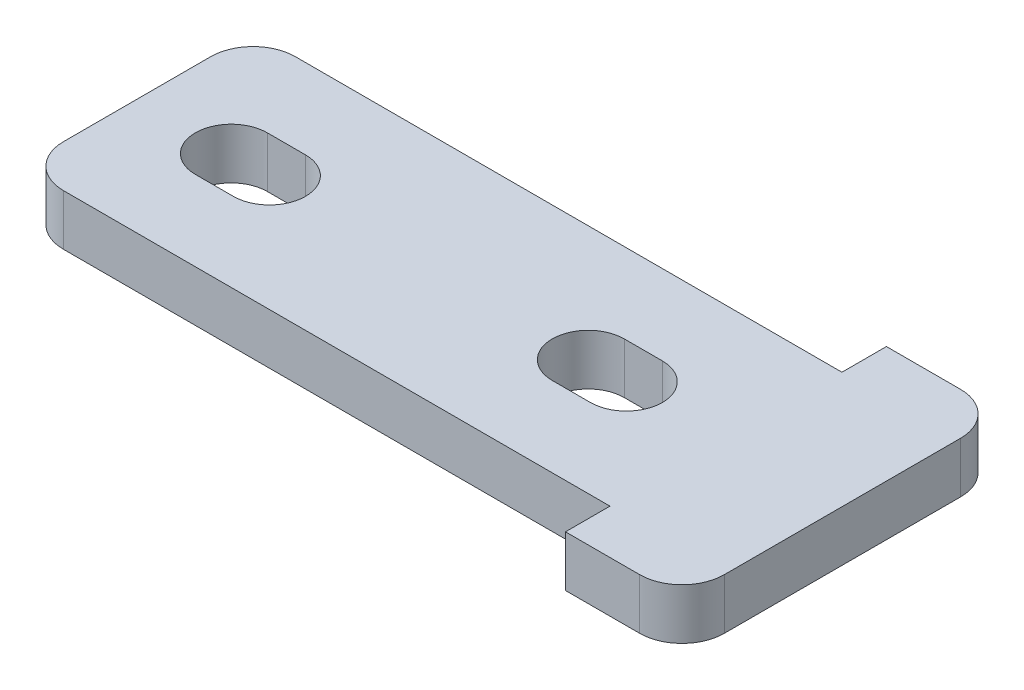
ISO-10303-21;
HEADER;
FILE_DESCRIPTION(('STEP AP214'),'2;1');
FILE_NAME('part.step','',(''),(''),'','','');
FILE_SCHEMA(('AUTOMOTIVE_DESIGN { 1 0 10303 214 1 1 1 1 }'));
ENDSEC;
DATA;
#1=APPLICATION_CONTEXT('core data for automotive mechanical design processes');
#2=APPLICATION_PROTOCOL_DEFINITION('international standard','automotive_design',2000,#1);
#3=PRODUCT_CONTEXT('',#1,'mechanical');
#4=PRODUCT('Part','Part','',(#3));
#5=PRODUCT_RELATED_PRODUCT_CATEGORY('part','',(#4));
#6=PRODUCT_DEFINITION_FORMATION('','',#4);
#7=PRODUCT_DEFINITION_CONTEXT('part definition',#1,'design');
#8=PRODUCT_DEFINITION('design','',#6,#7);
#9=PRODUCT_DEFINITION_SHAPE('','',#8);
#10=(LENGTH_UNIT() NAMED_UNIT(*) SI_UNIT(.MILLI.,.METRE.));
#11=(NAMED_UNIT(*) PLANE_ANGLE_UNIT() SI_UNIT($,.RADIAN.));
#12=(NAMED_UNIT(*) SI_UNIT($,.STERADIAN.) SOLID_ANGLE_UNIT());
#13=UNCERTAINTY_MEASURE_WITH_UNIT(LENGTH_MEASURE(1.E-05),#10,'distance_accuracy_value','');
#14=(GEOMETRIC_REPRESENTATION_CONTEXT(3) GLOBAL_UNCERTAINTY_ASSIGNED_CONTEXT((#13)) GLOBAL_UNIT_ASSIGNED_CONTEXT((#10,
#11,#12)) REPRESENTATION_CONTEXT('',''));
#15=CARTESIAN_POINT('',(0.,0.,0.));
#16=DIRECTION('',(0.,0.,1.));
#17=DIRECTION('',(1.,0.,0.));
#18=AXIS2_PLACEMENT_3D('',#15,#16,#17);
#19=CARTESIAN_POINT('',(0.,-2.4,-15.15));
#20=DIRECTION('',(0.,0.,1.));
#21=DIRECTION('',(1.,0.,0.));
#22=AXIS2_PLACEMENT_3D('',#19,#20,#21);
#23=PLANE('',#22);
#24=DIRECTION('',(1.,0.,0.));
#25=VECTOR('',#24,1.);
#26=CARTESIAN_POINT('',(0.,0.,-15.15));
#27=LINE('',#26,#25);
#28=CARTESIAN_POINT('',(27.8,0.,-15.15));
#29=VERTEX_POINT('',#28);
#30=CARTESIAN_POINT('',(31.3,0.,-15.15));
#31=VERTEX_POINT('',#30);
#32=EDGE_CURVE('E262',#29,#31,#27,.T.);
#33=ORIENTED_EDGE('',*,*,#32,.T.);
#34=DIRECTION('',(0.,1.,0.));
#35=VECTOR('',#34,1.);
#36=CARTESIAN_POINT('',(31.3,-2.4,-15.15));
#37=LINE('',#36,#35);
#38=CARTESIAN_POINT('',(31.3,-2.4,-15.15));
#39=VERTEX_POINT('',#38);
#40=EDGE_CURVE('E11',#31,#39,#37,.F.);
#41=ORIENTED_EDGE('',*,*,#40,.T.);
#42=DIRECTION('',(1.,0.,0.));
#43=VECTOR('',#42,1.);
#44=CARTESIAN_POINT('',(0.,-2.4,-15.15));
#45=LINE('',#44,#43);
#46=CARTESIAN_POINT('',(27.8,-2.4,-15.15));
#47=VERTEX_POINT('',#46);
#48=EDGE_CURVE('E225',#47,#39,#45,.T.);
#49=ORIENTED_EDGE('',*,*,#48,.F.);
#50=DIRECTION('',(0.,1.,0.));
#51=VECTOR('',#50,1.);
#52=CARTESIAN_POINT('',(27.8,-2.4,-15.15));
#53=LINE('',#52,#51);
#54=EDGE_CURVE('E289',#47,#29,#53,.T.);
#55=ORIENTED_EDGE('',*,*,#54,.T.);
#56=EDGE_LOOP('',(#33,#41,#49,#55));
#57=FACE_BOUND('',#56,.T.);
#58=ADVANCED_FACE('F42',(#57),#23,.F.);
#59=CARTESIAN_POINT('',(33.3,-2.4,0.));
#60=DIRECTION('',(1.,0.,0.));
#61=DIRECTION('',(0.,0.,-1.));
#62=AXIS2_PLACEMENT_3D('',#59,#60,#61);
#63=PLANE('',#62);
#64=DIRECTION('',(0.,0.,-1.));
#65=VECTOR('',#64,1.);
#66=CARTESIAN_POINT('',(33.3,0.,0.));
#67=LINE('',#66,#65);
#68=CARTESIAN_POINT('',(33.3,0.,-2.));
#69=VERTEX_POINT('',#68);
#70=CARTESIAN_POINT('',(33.3,0.,-13.15));
#71=VERTEX_POINT('',#70);
#72=EDGE_CURVE('E207',#69,#71,#67,.T.);
#73=ORIENTED_EDGE('',*,*,#72,.F.);
#74=DIRECTION('',(0.,1.,0.));
#75=VECTOR('',#74,1.);
#76=CARTESIAN_POINT('',(33.3,-2.4,-2.));
#77=LINE('',#76,#75);
#78=CARTESIAN_POINT('',(33.3,-2.4,-2.));
#79=VERTEX_POINT('',#78);
#80=EDGE_CURVE('E50',#69,#79,#77,.F.);
#81=ORIENTED_EDGE('',*,*,#80,.T.);
#82=DIRECTION('',(0.,0.,-1.));
#83=VECTOR('',#82,1.);
#84=CARTESIAN_POINT('',(33.3,-2.4,0.));
#85=LINE('',#84,#83);
#86=CARTESIAN_POINT('',(33.3,-2.4,-13.15));
#87=VERTEX_POINT('',#86);
#88=EDGE_CURVE('E202',#79,#87,#85,.T.);
#89=ORIENTED_EDGE('',*,*,#88,.T.);
#90=DIRECTION('',(0.,1.,0.));
#91=VECTOR('',#90,1.);
#92=CARTESIAN_POINT('',(33.3,0.,-13.15));
#93=LINE('',#92,#91);
#94=EDGE_CURVE('E331',#87,#71,#93,.T.);
#95=ORIENTED_EDGE('',*,*,#94,.T.);
#96=EDGE_LOOP('',(#73,#81,#89,#95));
#97=FACE_BOUND('',#96,.T.);
#98=ADVANCED_FACE('F336',(#97),#63,.T.);
#99=CARTESIAN_POINT('',(0.,-2.4,0.));
#100=DIRECTION('',(0.,0.,1.));
#101=DIRECTION('',(1.,0.,0.));
#102=AXIS2_PLACEMENT_3D('',#99,#100,#101);
#103=PLANE('',#102);
#104=DIRECTION('',(1.,0.,0.));
#105=VECTOR('',#104,1.);
#106=CARTESIAN_POINT('',(0.,-2.4,0.));
#107=LINE('',#106,#105);
#108=CARTESIAN_POINT('',(27.8,-2.4,0.));
#109=VERTEX_POINT('',#108);
#110=CARTESIAN_POINT('',(31.3,-2.4,0.));
#111=VERTEX_POINT('',#110);
#112=EDGE_CURVE('E240',#109,#111,#107,.T.);
#113=ORIENTED_EDGE('',*,*,#112,.T.);
#114=DIRECTION('',(0.,1.,0.));
#115=VECTOR('',#114,1.);
#116=CARTESIAN_POINT('',(31.3,-2.4,0.));
#117=LINE('',#116,#115);
#118=CARTESIAN_POINT('',(31.3,0.,0.));
#119=VERTEX_POINT('',#118);
#120=EDGE_CURVE('E328',#111,#119,#117,.T.);
#121=ORIENTED_EDGE('',*,*,#120,.T.);
#122=DIRECTION('',(1.,0.,0.));
#123=VECTOR('',#122,1.);
#124=CARTESIAN_POINT('',(0.,0.,0.));
#125=LINE('',#124,#123);
#126=CARTESIAN_POINT('',(27.8,0.,0.));
#127=VERTEX_POINT('',#126);
#128=EDGE_CURVE('E210',#127,#119,#125,.T.);
#129=ORIENTED_EDGE('',*,*,#128,.F.);
#130=DIRECTION('',(0.,1.,0.));
#131=VECTOR('',#130,1.);
#132=CARTESIAN_POINT('',(27.8,-2.4,0.));
#133=LINE('',#132,#131);
#134=EDGE_CURVE('E280',#109,#127,#133,.T.);
#135=ORIENTED_EDGE('',*,*,#134,.F.);
#136=EDGE_LOOP('',(#113,#121,#129,#135));
#137=FACE_BOUND('',#136,.T.);
#138=ADVANCED_FACE('F345',(#137),#103,.T.);
#139=CARTESIAN_POINT('',(27.8,-2.4,0.));
#140=DIRECTION('',(1.,0.,0.));
#141=DIRECTION('',(0.,0.,-1.));
#142=AXIS2_PLACEMENT_3D('',#139,#140,#141);
#143=PLANE('',#142);
#144=DIRECTION('',(0.,0.,-1.));
#145=VECTOR('',#144,1.);
#146=CARTESIAN_POINT('',(27.8,0.,0.));
#147=LINE('',#146,#145);
#148=CARTESIAN_POINT('',(27.8,0.,-2.1));
#149=VERTEX_POINT('',#148);
#150=EDGE_CURVE('E275',#127,#149,#147,.T.);
#151=ORIENTED_EDGE('',*,*,#150,.T.);
#152=DIRECTION('',(0.,1.,0.));
#153=VECTOR('',#152,1.);
#154=CARTESIAN_POINT('',(27.8,-2.4,-2.1));
#155=LINE('',#154,#153);
#156=CARTESIAN_POINT('',(27.8,-2.4,-2.1));
#157=VERTEX_POINT('',#156);
#158=EDGE_CURVE('E283',#157,#149,#155,.T.);
#159=ORIENTED_EDGE('',*,*,#158,.F.);
#160=DIRECTION('',(0.,0.,-1.));
#161=VECTOR('',#160,1.);
#162=CARTESIAN_POINT('',(27.8,-2.4,0.));
#163=LINE('',#162,#161);
#164=EDGE_CURVE('E237',#109,#157,#163,.T.);
#165=ORIENTED_EDGE('',*,*,#164,.F.);
#166=ORIENTED_EDGE('',*,*,#134,.T.);
#167=EDGE_LOOP('',(#151,#159,#165,#166));
#168=FACE_BOUND('',#167,.T.);
#169=ADVANCED_FACE('F353',(#168),#143,.F.);
#170=CARTESIAN_POINT('',(0.,-2.4,-2.1));
#171=DIRECTION('',(0.,0.,1.));
#172=DIRECTION('',(1.,0.,0.));
#173=AXIS2_PLACEMENT_3D('',#170,#171,#172);
#174=PLANE('',#173);
#175=DIRECTION('',(1.,0.,0.));
#176=VECTOR('',#175,1.);
#177=CARTESIAN_POINT('',(0.,0.,-2.1));
#178=LINE('',#177,#176);
#179=CARTESIAN_POINT('',(2.,0.,-2.1));
#180=VERTEX_POINT('',#179);
#181=EDGE_CURVE('E273',#180,#149,#178,.T.);
#182=ORIENTED_EDGE('',*,*,#181,.F.);
#183=DIRECTION('',(0.,1.,0.));
#184=VECTOR('',#183,1.);
#185=CARTESIAN_POINT('',(2.,-2.4,-2.1));
#186=LINE('',#185,#184);
#187=CARTESIAN_POINT('',(2.,-2.4,-2.1));
#188=VERTEX_POINT('',#187);
#189=EDGE_CURVE('E317',#180,#188,#186,.F.);
#190=ORIENTED_EDGE('',*,*,#189,.T.);
#191=DIRECTION('',(1.,0.,0.));
#192=VECTOR('',#191,1.);
#193=CARTESIAN_POINT('',(0.,-2.4,-2.1));
#194=LINE('',#193,#192);
#195=EDGE_CURVE('E235',#188,#157,#194,.T.);
#196=ORIENTED_EDGE('',*,*,#195,.T.);
#197=ORIENTED_EDGE('',*,*,#158,.T.);
#198=EDGE_LOOP('',(#182,#190,#196,#197));
#199=FACE_BOUND('',#198,.T.);
#200=ADVANCED_FACE('F535',(#199),#174,.T.);
#201=CARTESIAN_POINT('',(0.,-2.4,0.));
#202=DIRECTION('',(1.,0.,0.));
#203=DIRECTION('',(0.,0.,-1.));
#204=AXIS2_PLACEMENT_3D('',#201,#202,#203);
#205=PLANE('',#204);
#206=DIRECTION('',(0.,0.,-1.));
#207=VECTOR('',#206,1.);
#208=CARTESIAN_POINT('',(0.,-2.4,0.));
#209=LINE('',#208,#207);
#210=CARTESIAN_POINT('',(0.,-2.4,-4.1));
#211=VERTEX_POINT('',#210);
#212=CARTESIAN_POINT('',(0.,-2.4,-11.05));
#213=VERTEX_POINT('',#212);
#214=EDGE_CURVE('E233',#211,#213,#209,.T.);
#215=ORIENTED_EDGE('',*,*,#214,.F.);
#216=DIRECTION('',(0.,1.,0.));
#217=VECTOR('',#216,1.);
#218=CARTESIAN_POINT('',(0.,0.,-4.1));
#219=LINE('',#218,#217);
#220=CARTESIAN_POINT('',(0.,0.,-4.1));
#221=VERTEX_POINT('',#220);
#222=EDGE_CURVE('E306',#211,#221,#219,.T.);
#223=ORIENTED_EDGE('',*,*,#222,.T.);
#224=DIRECTION('',(0.,0.,-1.));
#225=VECTOR('',#224,1.);
#226=CARTESIAN_POINT('',(0.,0.,0.));
#227=LINE('',#226,#225);
#228=CARTESIAN_POINT('',(0.,0.,-11.05));
#229=VERTEX_POINT('',#228);
#230=EDGE_CURVE('E270',#221,#229,#227,.T.);
#231=ORIENTED_EDGE('',*,*,#230,.T.);
#232=DIRECTION('',(0.,1.,0.));
#233=VECTOR('',#232,1.);
#234=CARTESIAN_POINT('',(0.,-2.4,-11.05));
#235=LINE('',#234,#233);
#236=EDGE_CURVE('E282',#229,#213,#235,.F.);
#237=ORIENTED_EDGE('',*,*,#236,.T.);
#238=EDGE_LOOP('',(#215,#223,#231,#237));
#239=FACE_BOUND('',#238,.T.);
#240=ADVANCED_FACE('F363',(#239),#205,.F.);
#241=CARTESIAN_POINT('',(0.,-2.4,-13.05));
#242=DIRECTION('',(0.,0.,1.));
#243=DIRECTION('',(1.,0.,0.));
#244=AXIS2_PLACEMENT_3D('',#241,#242,#243);
#245=PLANE('',#244);
#246=DIRECTION('',(1.,0.,0.));
#247=VECTOR('',#246,1.);
#248=CARTESIAN_POINT('',(0.,-2.4,-13.05));
#249=LINE('',#248,#247);
#250=CARTESIAN_POINT('',(2.,-2.4,-13.05));
#251=VERTEX_POINT('',#250);
#252=CARTESIAN_POINT('',(27.8,-2.4,-13.05));
#253=VERTEX_POINT('',#252);
#254=EDGE_CURVE('E231',#251,#253,#249,.T.);
#255=ORIENTED_EDGE('',*,*,#254,.F.);
#256=DIRECTION('',(0.,1.,0.));
#257=VECTOR('',#256,1.);
#258=CARTESIAN_POINT('',(2.,-2.4,-13.05));
#259=LINE('',#258,#257);
#260=CARTESIAN_POINT('',(2.,0.,-13.05));
#261=VERTEX_POINT('',#260);
#262=EDGE_CURVE('E325',#251,#261,#259,.T.);
#263=ORIENTED_EDGE('',*,*,#262,.T.);
#264=DIRECTION('',(1.,0.,0.));
#265=VECTOR('',#264,1.);
#266=CARTESIAN_POINT('',(0.,0.,-13.05));
#267=LINE('',#266,#265);
#268=CARTESIAN_POINT('',(27.8,0.,-13.05));
#269=VERTEX_POINT('',#268);
#270=EDGE_CURVE('E268',#261,#269,#267,.T.);
#271=ORIENTED_EDGE('',*,*,#270,.T.);
#272=DIRECTION('',(0.,1.,0.));
#273=VECTOR('',#272,1.);
#274=CARTESIAN_POINT('',(27.8,-2.4,-13.05));
#275=LINE('',#274,#273);
#276=EDGE_CURVE('E286',#253,#269,#275,.T.);
#277=ORIENTED_EDGE('',*,*,#276,.F.);
#278=EDGE_LOOP('',(#255,#263,#271,#277));
#279=FACE_BOUND('',#278,.T.);
#280=ADVANCED_FACE('F370',(#279),#245,.F.);
#281=CARTESIAN_POINT('',(21.3,-2.4,-7.575));
#282=DIRECTION('',(0.,1.,0.));
#283=DIRECTION('',(0.,0.,1.));
#284=AXIS2_PLACEMENT_3D('',#281,#282,#283);
#285=CYLINDRICAL_SURFACE('',#284,1.7);
#286=CARTESIAN_POINT('',(21.3,0.,-7.575));
#287=DIRECTION('',(0.,1.,0.));
#288=DIRECTION('',(0.,0.,1.));
#289=AXIS2_PLACEMENT_3D('',#286,#287,#288);
#290=CIRCLE('',#289,1.7);
#291=CARTESIAN_POINT('',(21.3,0.,-9.275));
#292=VERTEX_POINT('',#291);
#293=CARTESIAN_POINT('',(21.3,0.,-5.875));
#294=VERTEX_POINT('',#293);
#295=EDGE_CURVE('E252',#292,#294,#290,.T.);
#296=ORIENTED_EDGE('',*,*,#295,.T.);
#297=DIRECTION('',(0.,1.,0.));
#298=VECTOR('',#297,1.);
#299=CARTESIAN_POINT('',(21.3,-2.4,-5.875));
#300=LINE('',#299,#298);
#301=CARTESIAN_POINT('',(21.3,-2.4,-5.875));
#302=VERTEX_POINT('',#301);
#303=EDGE_CURVE('E291',#302,#294,#300,.T.);
#304=ORIENTED_EDGE('',*,*,#303,.F.);
#305=CARTESIAN_POINT('',(21.3,-2.4,-7.575));
#306=DIRECTION('',(0.,1.,0.));
#307=DIRECTION('',(0.,0.,1.));
#308=AXIS2_PLACEMENT_3D('',#305,#306,#307);
#309=CIRCLE('',#308,1.7);
#310=CARTESIAN_POINT('',(21.3,-2.4,-9.275));
#311=VERTEX_POINT('',#310);
#312=EDGE_CURVE('E216',#311,#302,#309,.T.);
#313=ORIENTED_EDGE('',*,*,#312,.F.);
#314=DIRECTION('',(0.,1.,0.));
#315=VECTOR('',#314,1.);
#316=CARTESIAN_POINT('',(21.3,-2.4,-9.275));
#317=LINE('',#316,#315);
#318=EDGE_CURVE('E298',#311,#292,#317,.T.);
#319=ORIENTED_EDGE('',*,*,#318,.T.);
#320=EDGE_LOOP('',(#296,#304,#313,#319));
#321=FACE_BOUND('',#320,.T.);
#322=ADVANCED_FACE('F398',(#321),#285,.F.);
#323=CARTESIAN_POINT('',(0.,-2.4,-5.875));
#324=DIRECTION('',(0.,0.,-1.));
#325=DIRECTION('',(-1.,0.,0.));
#326=AXIS2_PLACEMENT_3D('',#323,#324,#325);
#327=PLANE('',#326);
#328=DIRECTION('',(-1.,0.,0.));
#329=VECTOR('',#328,1.);
#330=CARTESIAN_POINT('',(0.,0.,-5.875));
#331=LINE('',#330,#329);
#332=CARTESIAN_POINT('',(23.1,0.,-5.875));
#333=VERTEX_POINT('',#332);
#334=EDGE_CURVE('E259',#333,#294,#331,.T.);
#335=ORIENTED_EDGE('',*,*,#334,.F.);
#336=DIRECTION('',(0.,1.,0.));
#337=VECTOR('',#336,1.);
#338=CARTESIAN_POINT('',(23.1,-2.4,-5.875));
#339=LINE('',#338,#337);
#340=CARTESIAN_POINT('',(23.1,-2.4,-5.875));
#341=VERTEX_POINT('',#340);
#342=EDGE_CURVE('E293',#341,#333,#339,.T.);
#343=ORIENTED_EDGE('',*,*,#342,.F.);
#344=DIRECTION('',(-1.,0.,0.));
#345=VECTOR('',#344,1.);
#346=CARTESIAN_POINT('',(0.,-2.4,-5.875));
#347=LINE('',#346,#345);
#348=EDGE_CURVE('E222',#341,#302,#347,.T.);
#349=ORIENTED_EDGE('',*,*,#348,.T.);
#350=ORIENTED_EDGE('',*,*,#303,.T.);
#351=EDGE_LOOP('',(#335,#343,#349,#350));
#352=FACE_BOUND('',#351,.T.);
#353=ADVANCED_FACE('F394',(#352),#327,.T.);
#354=CARTESIAN_POINT('',(23.1,-2.4,-7.575));
#355=DIRECTION('',(0.,1.,0.));
#356=DIRECTION('',(0.,0.,1.));
#357=AXIS2_PLACEMENT_3D('',#354,#355,#356);
#358=CYLINDRICAL_SURFACE('',#357,1.7);
#359=CARTESIAN_POINT('',(23.1,0.,-7.575));
#360=DIRECTION('',(0.,1.,0.));
#361=DIRECTION('',(0.,0.,1.));
#362=AXIS2_PLACEMENT_3D('',#359,#360,#361);
#363=CIRCLE('',#362,1.7);
#364=CARTESIAN_POINT('',(23.1,0.,-9.275));
#365=VERTEX_POINT('',#364);
#366=EDGE_CURVE('E257',#333,#365,#363,.T.);
#367=ORIENTED_EDGE('',*,*,#366,.T.);
#368=DIRECTION('',(0.,1.,0.));
#369=VECTOR('',#368,1.);
#370=CARTESIAN_POINT('',(23.1,-2.4,-9.275));
#371=LINE('',#370,#369);
#372=CARTESIAN_POINT('',(23.1,-2.4,-9.275));
#373=VERTEX_POINT('',#372);
#374=EDGE_CURVE('E295',#373,#365,#371,.T.);
#375=ORIENTED_EDGE('',*,*,#374,.F.);
#376=CARTESIAN_POINT('',(23.1,-2.4,-7.575));
#377=DIRECTION('',(0.,1.,0.));
#378=DIRECTION('',(0.,0.,1.));
#379=AXIS2_PLACEMENT_3D('',#376,#377,#378);
#380=CIRCLE('',#379,1.7);
#381=EDGE_CURVE('E220',#341,#373,#380,.T.);
#382=ORIENTED_EDGE('',*,*,#381,.F.);
#383=ORIENTED_EDGE('',*,*,#342,.T.);
#384=EDGE_LOOP('',(#367,#375,#382,#383));
#385=FACE_BOUND('',#384,.T.);
#386=ADVANCED_FACE('F397',(#385),#358,.F.);
#387=CARTESIAN_POINT('',(6.25,-2.4,-7.575));
#388=DIRECTION('',(0.,1.,0.));
#389=DIRECTION('',(0.,0.,1.));
#390=AXIS2_PLACEMENT_3D('',#387,#388,#389);
#391=CYLINDRICAL_SURFACE('',#390,1.7);
#392=CARTESIAN_POINT('',(6.25,0.,-7.575));
#393=DIRECTION('',(0.,1.,0.));
#394=DIRECTION('',(0.,0.,1.));
#395=AXIS2_PLACEMENT_3D('',#392,#393,#394);
#396=CIRCLE('',#395,1.7);
#397=CARTESIAN_POINT('',(6.25,0.,-5.875));
#398=VERTEX_POINT('',#397);
#399=CARTESIAN_POINT('',(6.25,0.,-9.275));
#400=VERTEX_POINT('',#399);
#401=EDGE_CURVE('E244',#398,#400,#396,.T.);
#402=ORIENTED_EDGE('',*,*,#401,.T.);
#403=DIRECTION('',(0.,1.,0.));
#404=VECTOR('',#403,1.);
#405=CARTESIAN_POINT('',(6.25,-2.4,-9.275));
#406=LINE('',#405,#404);
#407=CARTESIAN_POINT('',(6.25,-2.4,-9.275));
#408=VERTEX_POINT('',#407);
#409=EDGE_CURVE('E205',#408,#400,#406,.T.);
#410=ORIENTED_EDGE('',*,*,#409,.F.);
#411=CARTESIAN_POINT('',(6.25,-2.4,-7.575));
#412=DIRECTION('',(0.,1.,0.));
#413=DIRECTION('',(0.,0.,1.));
#414=AXIS2_PLACEMENT_3D('',#411,#412,#413);
#415=CIRCLE('',#414,1.7);
#416=CARTESIAN_POINT('',(6.25,-2.4,-5.875));
#417=VERTEX_POINT('',#416);
#418=EDGE_CURVE('E185',#417,#408,#415,.T.);
#419=ORIENTED_EDGE('',*,*,#418,.F.);
#420=DIRECTION('',(0.,1.,0.));
#421=VECTOR('',#420,1.);
#422=CARTESIAN_POINT('',(6.25,-2.4,-5.875));
#423=LINE('',#422,#421);
#424=EDGE_CURVE('E194',#417,#398,#423,.T.);
#425=ORIENTED_EDGE('',*,*,#424,.T.);
#426=EDGE_LOOP('',(#402,#410,#419,#425));
#427=FACE_BOUND('',#426,.T.);
#428=ADVANCED_FACE('F204',(#427),#391,.F.);
#429=CARTESIAN_POINT('',(0.,-2.4,-9.275));
#430=DIRECTION('',(0.,0.,1.));
#431=DIRECTION('',(1.,0.,0.));
#432=AXIS2_PLACEMENT_3D('',#429,#430,#431);
#433=PLANE('',#432);
#434=DIRECTION('',(1.,0.,0.));
#435=VECTOR('',#434,1.);
#436=CARTESIAN_POINT('',(0.,0.,-9.275));
#437=LINE('',#436,#435);
#438=CARTESIAN_POINT('',(4.45,0.,-9.275));
#439=VERTEX_POINT('',#438);
#440=EDGE_CURVE('E249',#439,#400,#437,.T.);
#441=ORIENTED_EDGE('',*,*,#440,.F.);
#442=DIRECTION('',(0.,1.,0.));
#443=VECTOR('',#442,1.);
#444=CARTESIAN_POINT('',(4.45,-2.4,-9.275));
#445=LINE('',#444,#443);
#446=CARTESIAN_POINT('',(4.45,-2.4,-9.275));
#447=VERTEX_POINT('',#446);
#448=EDGE_CURVE('E302',#447,#439,#445,.T.);
#449=ORIENTED_EDGE('',*,*,#448,.F.);
#450=DIRECTION('',(1.,0.,0.));
#451=VECTOR('',#450,1.);
#452=CARTESIAN_POINT('',(0.,-2.4,-9.275));
#453=LINE('',#452,#451);
#454=EDGE_CURVE('E214',#447,#408,#453,.T.);
#455=ORIENTED_EDGE('',*,*,#454,.T.);
#456=ORIENTED_EDGE('',*,*,#409,.T.);
#457=EDGE_LOOP('',(#441,#449,#455,#456));
#458=FACE_BOUND('',#457,.T.);
#459=ADVANCED_FACE('F411',(#458),#433,.T.);
#460=CARTESIAN_POINT('',(4.45,-2.4,-7.575));
#461=DIRECTION('',(0.,1.,0.));
#462=DIRECTION('',(0.,0.,1.));
#463=AXIS2_PLACEMENT_3D('',#460,#461,#462);
#464=CYLINDRICAL_SURFACE('',#463,1.7);
#465=CARTESIAN_POINT('',(4.45,0.,-7.575));
#466=DIRECTION('',(0.,1.,0.));
#467=DIRECTION('',(0.,0.,1.));
#468=AXIS2_PLACEMENT_3D('',#465,#466,#467);
#469=CIRCLE('',#468,1.7);
#470=CARTESIAN_POINT('',(4.45,0.,-5.875));
#471=VERTEX_POINT('',#470);
#472=EDGE_CURVE('E247',#439,#471,#469,.T.);
#473=ORIENTED_EDGE('',*,*,#472,.T.);
#474=DIRECTION('',(0.,1.,0.));
#475=VECTOR('',#474,1.);
#476=CARTESIAN_POINT('',(4.45,-2.4,-5.875));
#477=LINE('',#476,#475);
#478=CARTESIAN_POINT('',(4.45,-2.4,-5.875));
#479=VERTEX_POINT('',#478);
#480=EDGE_CURVE('E201',#479,#471,#477,.T.);
#481=ORIENTED_EDGE('',*,*,#480,.F.);
#482=CARTESIAN_POINT('',(4.45,-2.4,-7.575));
#483=DIRECTION('',(0.,1.,0.));
#484=DIRECTION('',(0.,0.,1.));
#485=AXIS2_PLACEMENT_3D('',#482,#483,#484);
#486=CIRCLE('',#485,1.7);
#487=EDGE_CURVE('E188',#447,#479,#486,.T.);
#488=ORIENTED_EDGE('',*,*,#487,.F.);
#489=ORIENTED_EDGE('',*,*,#448,.T.);
#490=EDGE_LOOP('',(#473,#481,#488,#489));
#491=FACE_BOUND('',#490,.T.);
#492=ADVANCED_FACE('F406',(#491),#464,.F.);
#493=CARTESIAN_POINT('',(0.,-2.4,-9.275));
#494=DIRECTION('',(0.,0.,-1.));
#495=DIRECTION('',(-1.,0.,0.));
#496=AXIS2_PLACEMENT_3D('',#493,#494,#495);
#497=PLANE('',#496);
#498=DIRECTION('',(-1.,0.,0.));
#499=VECTOR('',#498,1.);
#500=CARTESIAN_POINT('',(0.,0.,-9.275));
#501=LINE('',#500,#499);
#502=EDGE_CURVE('E255',#365,#292,#501,.T.);
#503=ORIENTED_EDGE('',*,*,#502,.T.);
#504=ORIENTED_EDGE('',*,*,#318,.F.);
#505=DIRECTION('',(-1.,0.,0.));
#506=VECTOR('',#505,1.);
#507=CARTESIAN_POINT('',(0.,-2.4,-9.275));
#508=LINE('',#507,#506);
#509=EDGE_CURVE('E218',#373,#311,#508,.T.);
#510=ORIENTED_EDGE('',*,*,#509,.F.);
#511=ORIENTED_EDGE('',*,*,#374,.T.);
#512=EDGE_LOOP('',(#503,#504,#510,#511));
#513=FACE_BOUND('',#512,.T.);
#514=ADVANCED_FACE('F403',(#513),#497,.F.);
#515=CARTESIAN_POINT('',(0.,-2.4,-5.875));
#516=DIRECTION('',(0.,0.,1.));
#517=DIRECTION('',(1.,0.,0.));
#518=AXIS2_PLACEMENT_3D('',#515,#516,#517);
#519=PLANE('',#518);
#520=DIRECTION('',(1.,0.,0.));
#521=VECTOR('',#520,1.);
#522=CARTESIAN_POINT('',(0.,0.,-5.875));
#523=LINE('',#522,#521);
#524=EDGE_CURVE('E197',#471,#398,#523,.T.);
#525=ORIENTED_EDGE('',*,*,#524,.T.);
#526=ORIENTED_EDGE('',*,*,#424,.F.);
#527=DIRECTION('',(1.,0.,0.));
#528=VECTOR('',#527,1.);
#529=CARTESIAN_POINT('',(0.,-2.4,-5.875));
#530=LINE('',#529,#528);
#531=EDGE_CURVE('E179',#479,#417,#530,.T.);
#532=ORIENTED_EDGE('',*,*,#531,.F.);
#533=ORIENTED_EDGE('',*,*,#480,.T.);
#534=EDGE_LOOP('',(#525,#526,#532,#533));
#535=FACE_BOUND('',#534,.T.);
#536=ADVANCED_FACE('F195',(#535),#519,.F.);
#537=CARTESIAN_POINT('',(27.8,-2.4,0.));
#538=DIRECTION('',(-1.,0.,0.));
#539=DIRECTION('',(0.,0.,1.));
#540=AXIS2_PLACEMENT_3D('',#537,#538,#539);
#541=PLANE('',#540);
#542=DIRECTION('',(0.,0.,1.));
#543=VECTOR('',#542,1.);
#544=CARTESIAN_POINT('',(27.8,0.,0.));
#545=LINE('',#544,#543);
#546=EDGE_CURVE('E265',#29,#269,#545,.T.);
#547=ORIENTED_EDGE('',*,*,#546,.F.);
#548=ORIENTED_EDGE('',*,*,#54,.F.);
#549=DIRECTION('',(0.,0.,1.));
#550=VECTOR('',#549,1.);
#551=CARTESIAN_POINT('',(27.8,-2.4,0.));
#552=LINE('',#551,#550);
#553=EDGE_CURVE('E228',#47,#253,#552,.T.);
#554=ORIENTED_EDGE('',*,*,#553,.T.);
#555=ORIENTED_EDGE('',*,*,#276,.T.);
#556=EDGE_LOOP('',(#547,#548,#554,#555));
#557=FACE_BOUND('',#556,.T.);
#558=ADVANCED_FACE('F376',(#557),#541,.T.);
#559=CARTESIAN_POINT('',(0.,-2.4,0.));
#560=DIRECTION('',(0.,1.,0.));
#561=DIRECTION('',(0.,0.,1.));
#562=AXIS2_PLACEMENT_3D('',#559,#560,#561);
#563=PLANE('',#562);
#564=ORIENTED_EDGE('',*,*,#418,.T.);
#565=ORIENTED_EDGE('',*,*,#454,.F.);
#566=ORIENTED_EDGE('',*,*,#487,.T.);
#567=ORIENTED_EDGE('',*,*,#531,.T.);
#568=EDGE_LOOP('',(#564,#565,#566,#567));
#569=FACE_BOUND('',#568,.T.);
#570=ORIENTED_EDGE('',*,*,#312,.T.);
#571=ORIENTED_EDGE('',*,*,#348,.F.);
#572=ORIENTED_EDGE('',*,*,#381,.T.);
#573=ORIENTED_EDGE('',*,*,#509,.T.);
#574=EDGE_LOOP('',(#570,#571,#572,#573));
#575=FACE_BOUND('',#574,.T.);
#576=ORIENTED_EDGE('',*,*,#195,.F.);
#577=CARTESIAN_POINT('',(2.,-2.4,-4.1));
#578=DIRECTION('',(0.,1.,0.));
#579=DIRECTION('',(0.,0.,1.));
#580=AXIS2_PLACEMENT_3D('',#577,#578,#579);
#581=CIRCLE('',#580,2.);
#582=EDGE_CURVE('E323',#188,#211,#581,.F.);
#583=ORIENTED_EDGE('',*,*,#582,.T.);
#584=ORIENTED_EDGE('',*,*,#214,.T.);
#585=CARTESIAN_POINT('',(2.,-2.4,-11.05));
#586=DIRECTION('',(0.,1.,0.));
#587=DIRECTION('',(0.,0.,1.));
#588=AXIS2_PLACEMENT_3D('',#585,#586,#587);
#589=CIRCLE('',#588,2.);
#590=EDGE_CURVE('E57',#213,#251,#589,.F.);
#591=ORIENTED_EDGE('',*,*,#590,.T.);
#592=ORIENTED_EDGE('',*,*,#254,.T.);
#593=ORIENTED_EDGE('',*,*,#553,.F.);
#594=ORIENTED_EDGE('',*,*,#48,.T.);
#595=CARTESIAN_POINT('',(31.3,-2.4,-13.15));
#596=DIRECTION('',(0.,1.,0.));
#597=DIRECTION('',(0.,0.,1.));
#598=AXIS2_PLACEMENT_3D('',#595,#596,#597);
#599=CIRCLE('',#598,2.);
#600=EDGE_CURVE('E319',#39,#87,#599,.F.);
#601=ORIENTED_EDGE('',*,*,#600,.T.);
#602=ORIENTED_EDGE('',*,*,#88,.F.);
#603=CARTESIAN_POINT('',(31.3,-2.4,-2.));
#604=DIRECTION('',(0.,1.,0.));
#605=DIRECTION('',(0.,0.,1.));
#606=AXIS2_PLACEMENT_3D('',#603,#604,#605);
#607=CIRCLE('',#606,2.);
#608=EDGE_CURVE('E64',#79,#111,#607,.F.);
#609=ORIENTED_EDGE('',*,*,#608,.T.);
#610=ORIENTED_EDGE('',*,*,#112,.F.);
#611=ORIENTED_EDGE('',*,*,#164,.T.);
#612=EDGE_LOOP('',(#576,#583,#584,#591,#592,#593,#594,#601,#602,#609,#610,#611));
#613=FACE_BOUND('',#612,.T.);
#614=ADVANCED_FACE('F181',(#569,#575,#613),#563,.F.);
#615=CARTESIAN_POINT('',(0.,0.,0.));
#616=DIRECTION('',(0.,1.,0.));
#617=DIRECTION('',(0.,0.,1.));
#618=AXIS2_PLACEMENT_3D('',#615,#616,#617);
#619=PLANE('',#618);
#620=ORIENTED_EDGE('',*,*,#401,.F.);
#621=ORIENTED_EDGE('',*,*,#524,.F.);
#622=ORIENTED_EDGE('',*,*,#472,.F.);
#623=ORIENTED_EDGE('',*,*,#440,.T.);
#624=EDGE_LOOP('',(#620,#621,#622,#623));
#625=FACE_BOUND('',#624,.T.);
#626=ORIENTED_EDGE('',*,*,#295,.F.);
#627=ORIENTED_EDGE('',*,*,#502,.F.);
#628=ORIENTED_EDGE('',*,*,#366,.F.);
#629=ORIENTED_EDGE('',*,*,#334,.T.);
#630=EDGE_LOOP('',(#626,#627,#628,#629));
#631=FACE_BOUND('',#630,.T.);
#632=ORIENTED_EDGE('',*,*,#230,.F.);
#633=CARTESIAN_POINT('',(2.,0.,-4.1));
#634=DIRECTION('',(0.,1.,0.));
#635=DIRECTION('',(0.,0.,1.));
#636=AXIS2_PLACEMENT_3D('',#633,#634,#635);
#637=CIRCLE('',#636,2.);
#638=EDGE_CURVE('E315',#221,#180,#637,.T.);
#639=ORIENTED_EDGE('',*,*,#638,.T.);
#640=ORIENTED_EDGE('',*,*,#181,.T.);
#641=ORIENTED_EDGE('',*,*,#150,.F.);
#642=ORIENTED_EDGE('',*,*,#128,.T.);
#643=CARTESIAN_POINT('',(31.3,0.,-2.));
#644=DIRECTION('',(0.,1.,0.));
#645=DIRECTION('',(0.,0.,1.));
#646=AXIS2_PLACEMENT_3D('',#643,#644,#645);
#647=CIRCLE('',#646,2.);
#648=EDGE_CURVE('E311',#119,#69,#647,.T.);
#649=ORIENTED_EDGE('',*,*,#648,.T.);
#650=ORIENTED_EDGE('',*,*,#72,.T.);
#651=CARTESIAN_POINT('',(31.3,0.,-13.15));
#652=DIRECTION('',(0.,1.,0.));
#653=DIRECTION('',(0.,0.,1.));
#654=AXIS2_PLACEMENT_3D('',#651,#652,#653);
#655=CIRCLE('',#654,2.);
#656=EDGE_CURVE('E309',#71,#31,#655,.T.);
#657=ORIENTED_EDGE('',*,*,#656,.T.);
#658=ORIENTED_EDGE('',*,*,#32,.F.);
#659=ORIENTED_EDGE('',*,*,#546,.T.);
#660=ORIENTED_EDGE('',*,*,#270,.F.);
#661=CARTESIAN_POINT('',(2.,0.,-11.05));
#662=DIRECTION('',(0.,1.,0.));
#663=DIRECTION('',(0.,0.,1.));
#664=AXIS2_PLACEMENT_3D('',#661,#662,#663);
#665=CIRCLE('',#664,2.);
#666=EDGE_CURVE('E313',#261,#229,#665,.T.);
#667=ORIENTED_EDGE('',*,*,#666,.T.);
#668=EDGE_LOOP('',(#632,#639,#640,#641,#642,#649,#650,#657,#658,#659,#660,#667));
#669=FACE_BOUND('',#668,.T.);
#670=ADVANCED_FACE('F349',(#625,#631,#669),#619,.T.);
#671=CARTESIAN_POINT('',(2.,-2.4,-4.1));
#672=DIRECTION('',(0.,-1.,0.));
#673=DIRECTION('',(0.,0.,-1.));
#674=AXIS2_PLACEMENT_3D('',#671,#672,#673);
#675=CYLINDRICAL_SURFACE('',#674,2.);
#676=ORIENTED_EDGE('',*,*,#582,.F.);
#677=ORIENTED_EDGE('',*,*,#189,.F.);
#678=ORIENTED_EDGE('',*,*,#638,.F.);
#679=ORIENTED_EDGE('',*,*,#222,.F.);
#680=EDGE_LOOP('',(#676,#677,#678,#679));
#681=FACE_BOUND('',#680,.T.);
#682=ADVANCED_FACE('F361',(#681),#675,.T.);
#683=CARTESIAN_POINT('',(2.,-2.4,-11.05));
#684=DIRECTION('',(0.,1.,0.));
#685=DIRECTION('',(0.,0.,1.));
#686=AXIS2_PLACEMENT_3D('',#683,#684,#685);
#687=CYLINDRICAL_SURFACE('',#686,2.);
#688=ORIENTED_EDGE('',*,*,#590,.F.);
#689=ORIENTED_EDGE('',*,*,#236,.F.);
#690=ORIENTED_EDGE('',*,*,#666,.F.);
#691=ORIENTED_EDGE('',*,*,#262,.F.);
#692=EDGE_LOOP('',(#688,#689,#690,#691));
#693=FACE_BOUND('',#692,.T.);
#694=ADVANCED_FACE('F368',(#693),#687,.T.);
#695=CARTESIAN_POINT('',(31.3,-2.4,-2.));
#696=DIRECTION('',(0.,1.,0.));
#697=DIRECTION('',(0.,0.,1.));
#698=AXIS2_PLACEMENT_3D('',#695,#696,#697);
#699=CYLINDRICAL_SURFACE('',#698,2.);
#700=ORIENTED_EDGE('',*,*,#608,.F.);
#701=ORIENTED_EDGE('',*,*,#80,.F.);
#702=ORIENTED_EDGE('',*,*,#648,.F.);
#703=ORIENTED_EDGE('',*,*,#120,.F.);
#704=EDGE_LOOP('',(#700,#701,#702,#703));
#705=FACE_BOUND('',#704,.T.);
#706=ADVANCED_FACE('F342',(#705),#699,.T.);
#707=CARTESIAN_POINT('',(31.3,-2.4,-13.15));
#708=DIRECTION('',(0.,-1.,0.));
#709=DIRECTION('',(0.,0.,-1.));
#710=AXIS2_PLACEMENT_3D('',#707,#708,#709);
#711=CYLINDRICAL_SURFACE('',#710,2.);
#712=ORIENTED_EDGE('',*,*,#600,.F.);
#713=ORIENTED_EDGE('',*,*,#40,.F.);
#714=ORIENTED_EDGE('',*,*,#656,.F.);
#715=ORIENTED_EDGE('',*,*,#94,.F.);
#716=EDGE_LOOP('',(#712,#713,#714,#715));
#717=FACE_BOUND('',#716,.T.);
#718=ADVANCED_FACE('F44',(#717),#711,.T.);
#719=CLOSED_SHELL('',(#58,#98,#138,#169,#200,#240,#280,#322,#353,#386,#428,#459,#492,#514,#536,
#558,#614,#670,#682,#694,#706,#718));
#720=MANIFOLD_SOLID_BREP('B2',#719);
#721=ADVANCED_BREP_SHAPE_REPRESENTATION('',(#18,#720),#14);
#722=SHAPE_DEFINITION_REPRESENTATION(#9,#721);
ENDSEC;
END-ISO-10303-21;
